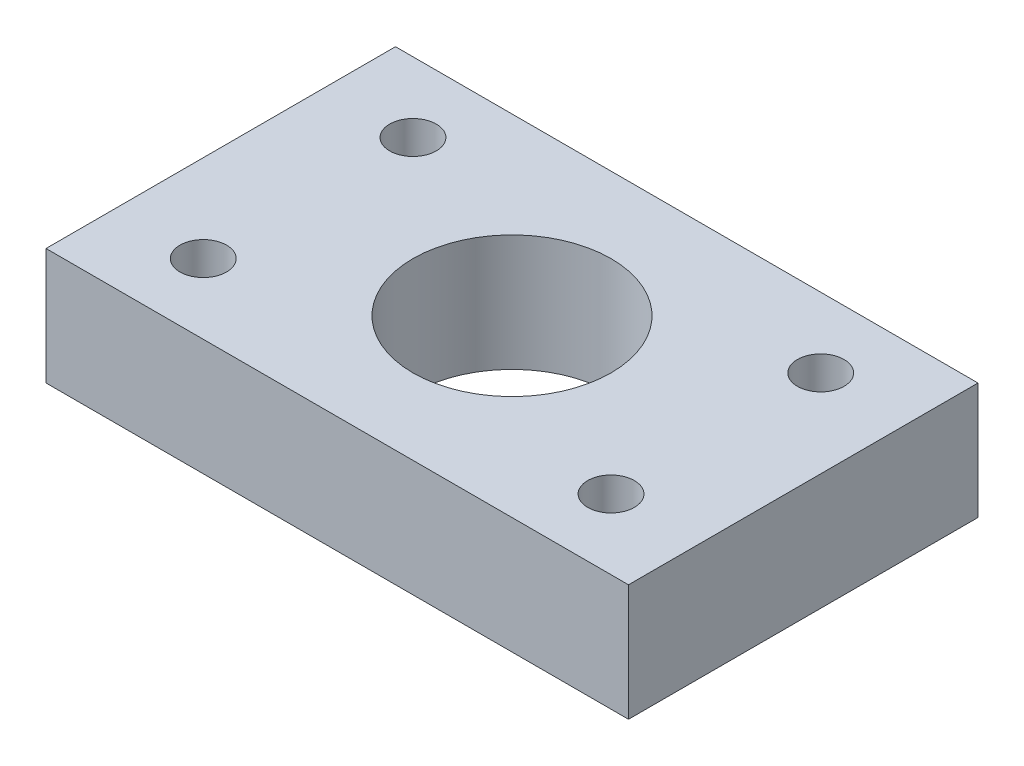
ISO-10303-21;
HEADER;
FILE_DESCRIPTION(('STEP AP214'),'2;1');
FILE_NAME('part.step','',(''),(''),'','','');
FILE_SCHEMA(('AUTOMOTIVE_DESIGN { 1 0 10303 214 1 1 1 1 }'));
ENDSEC;
DATA;
#1=APPLICATION_CONTEXT('core data for automotive mechanical design processes');
#2=APPLICATION_PROTOCOL_DEFINITION('international standard','automotive_design',2000,#1);
#3=PRODUCT_CONTEXT('',#1,'mechanical');
#4=PRODUCT('Part','Part','',(#3));
#5=PRODUCT_RELATED_PRODUCT_CATEGORY('part','',(#4));
#6=PRODUCT_DEFINITION_FORMATION('','',#4);
#7=PRODUCT_DEFINITION_CONTEXT('part definition',#1,'design');
#8=PRODUCT_DEFINITION('design','',#6,#7);
#9=PRODUCT_DEFINITION_SHAPE('','',#8);
#10=(LENGTH_UNIT() NAMED_UNIT(*) SI_UNIT(.MILLI.,.METRE.));
#11=(NAMED_UNIT(*) PLANE_ANGLE_UNIT() SI_UNIT($,.RADIAN.));
#12=(NAMED_UNIT(*) SI_UNIT($,.STERADIAN.) SOLID_ANGLE_UNIT());
#13=UNCERTAINTY_MEASURE_WITH_UNIT(LENGTH_MEASURE(1.E-05),#10,'distance_accuracy_value','');
#14=(GEOMETRIC_REPRESENTATION_CONTEXT(3) GLOBAL_UNCERTAINTY_ASSIGNED_CONTEXT((#13)) GLOBAL_UNIT_ASSIGNED_CONTEXT((#10,
#11,#12)) REPRESENTATION_CONTEXT('',''));
#15=CARTESIAN_POINT('',(0.,0.,0.));
#16=DIRECTION('',(0.,0.,1.));
#17=DIRECTION('',(1.,0.,0.));
#18=AXIS2_PLACEMENT_3D('',#15,#16,#17);
#19=CARTESIAN_POINT('',(0.,10.,0.));
#20=DIRECTION('',(0.,1.,0.));
#21=DIRECTION('',(0.,0.,1.));
#22=AXIS2_PLACEMENT_3D('',#19,#20,#21);
#23=PLANE('',#22);
#24=CARTESIAN_POINT('',(17.5,10.,9.00000000000001));
#25=DIRECTION('',(0.,1.,0.));
#26=DIRECTION('',(0.,0.,1.));
#27=AXIS2_PLACEMENT_3D('',#24,#25,#26);
#28=CIRCLE('',#27,2.);
#29=CARTESIAN_POINT('',(17.5,10.,11.));
#30=VERTEX_POINT('',#29);
#31=EDGE_CURVE('E128',#30,#30,#28,.T.);
#32=ORIENTED_EDGE('',*,*,#31,.F.);
#33=EDGE_LOOP('',(#32));
#34=FACE_BOUND('',#33,.T.);
#35=CARTESIAN_POINT('',(-17.5,10.,-9.));
#36=DIRECTION('',(0.,1.,0.));
#37=DIRECTION('',(0.,0.,1.));
#38=AXIS2_PLACEMENT_3D('',#35,#36,#37);
#39=CIRCLE('',#38,2.);
#40=CARTESIAN_POINT('',(-17.5,10.,-7.));
#41=VERTEX_POINT('',#40);
#42=EDGE_CURVE('E116',#41,#41,#39,.T.);
#43=ORIENTED_EDGE('',*,*,#42,.F.);
#44=EDGE_LOOP('',(#43));
#45=FACE_BOUND('',#44,.T.);
#46=DIRECTION('',(0.,0.,1.));
#47=VECTOR('',#46,1.);
#48=CARTESIAN_POINT('',(-25.,10.,15.));
#49=LINE('',#48,#47);
#50=CARTESIAN_POINT('',(-25.,10.,-15.));
#51=VERTEX_POINT('',#50);
#52=CARTESIAN_POINT('',(-25.,10.,15.));
#53=VERTEX_POINT('',#52);
#54=EDGE_CURVE('E86',#51,#53,#49,.T.);
#55=ORIENTED_EDGE('',*,*,#54,.T.);
#56=DIRECTION('',(1.,0.,0.));
#57=VECTOR('',#56,1.);
#58=CARTESIAN_POINT('',(25.,10.,15.));
#59=LINE('',#58,#57);
#60=CARTESIAN_POINT('',(25.,10.,15.));
#61=VERTEX_POINT('',#60);
#62=EDGE_CURVE('E81',#53,#61,#59,.T.);
#63=ORIENTED_EDGE('',*,*,#62,.T.);
#64=DIRECTION('',(0.,0.,-1.));
#65=VECTOR('',#64,1.);
#66=CARTESIAN_POINT('',(25.,10.,15.));
#67=LINE('',#66,#65);
#68=CARTESIAN_POINT('',(25.,10.,-15.));
#69=VERTEX_POINT('',#68);
#70=EDGE_CURVE('E84',#61,#69,#67,.T.);
#71=ORIENTED_EDGE('',*,*,#70,.T.);
#72=DIRECTION('',(-1.,0.,0.));
#73=VECTOR('',#72,1.);
#74=CARTESIAN_POINT('',(25.,10.,-15.));
#75=LINE('',#74,#73);
#76=EDGE_CURVE('E51',#69,#51,#75,.T.);
#77=ORIENTED_EDGE('',*,*,#76,.T.);
#78=EDGE_LOOP('',(#55,#63,#71,#77));
#79=FACE_BOUND('',#78,.T.);
#80=CARTESIAN_POINT('',(0.,10.,0.));
#81=DIRECTION('',(0.,1.,0.));
#82=DIRECTION('',(0.,0.,1.));
#83=AXIS2_PLACEMENT_3D('',#80,#81,#82);
#84=CIRCLE('',#83,8.5);
#85=CARTESIAN_POINT('',(0.,10.,8.5));
#86=VERTEX_POINT('',#85);
#87=EDGE_CURVE('E101',#86,#86,#84,.T.);
#88=ORIENTED_EDGE('',*,*,#87,.F.);
#89=EDGE_LOOP('',(#88));
#90=FACE_BOUND('',#89,.T.);
#91=CARTESIAN_POINT('',(17.5,10.,-9.00000000000001));
#92=DIRECTION('',(0.,1.,0.));
#93=DIRECTION('',(0.,0.,-1.));
#94=AXIS2_PLACEMENT_3D('',#91,#92,#93);
#95=CIRCLE('',#94,2.);
#96=CARTESIAN_POINT('',(17.5,10.,-11.));
#97=VERTEX_POINT('',#96);
#98=EDGE_CURVE('E122',#97,#97,#95,.T.);
#99=ORIENTED_EDGE('',*,*,#98,.F.);
#100=EDGE_LOOP('',(#99));
#101=FACE_BOUND('',#100,.T.);
#102=CARTESIAN_POINT('',(-17.5,10.,9.));
#103=DIRECTION('',(0.,1.,0.));
#104=DIRECTION('',(0.,0.,-1.));
#105=AXIS2_PLACEMENT_3D('',#102,#103,#104);
#106=CIRCLE('',#105,2.);
#107=CARTESIAN_POINT('',(-17.5,10.,7.));
#108=VERTEX_POINT('',#107);
#109=EDGE_CURVE('E134',#108,#108,#106,.T.);
#110=ORIENTED_EDGE('',*,*,#109,.F.);
#111=EDGE_LOOP('',(#110));
#112=FACE_BOUND('',#111,.T.);
#113=ADVANCED_FACE('F34',(#34,#45,#79,#90,#101,#112),#23,.T.);
#114=CARTESIAN_POINT('',(0.,0.,0.));
#115=DIRECTION('',(0.,1.,0.));
#116=DIRECTION('',(0.,0.,1.));
#117=AXIS2_PLACEMENT_3D('',#114,#115,#116);
#118=PLANE('',#117);
#119=DIRECTION('',(0.,0.,1.));
#120=VECTOR('',#119,1.);
#121=CARTESIAN_POINT('',(-25.,0.,15.));
#122=LINE('',#121,#120);
#123=CARTESIAN_POINT('',(-25.,0.,-15.));
#124=VERTEX_POINT('',#123);
#125=CARTESIAN_POINT('',(-25.,0.,15.));
#126=VERTEX_POINT('',#125);
#127=EDGE_CURVE('E98',#124,#126,#122,.T.);
#128=ORIENTED_EDGE('',*,*,#127,.F.);
#129=DIRECTION('',(-1.,0.,0.));
#130=VECTOR('',#129,1.);
#131=CARTESIAN_POINT('',(25.,0.,-15.));
#132=LINE('',#131,#130);
#133=CARTESIAN_POINT('',(25.,0.,-15.));
#134=VERTEX_POINT('',#133);
#135=EDGE_CURVE('E74',#134,#124,#132,.T.);
#136=ORIENTED_EDGE('',*,*,#135,.F.);
#137=DIRECTION('',(0.,0.,-1.));
#138=VECTOR('',#137,1.);
#139=CARTESIAN_POINT('',(25.,0.,15.));
#140=LINE('',#139,#138);
#141=CARTESIAN_POINT('',(25.,0.,15.));
#142=VERTEX_POINT('',#141);
#143=EDGE_CURVE('E68',#142,#134,#140,.T.);
#144=ORIENTED_EDGE('',*,*,#143,.F.);
#145=DIRECTION('',(1.,0.,0.));
#146=VECTOR('',#145,1.);
#147=CARTESIAN_POINT('',(25.,0.,15.));
#148=LINE('',#147,#146);
#149=EDGE_CURVE('E90',#126,#142,#148,.T.);
#150=ORIENTED_EDGE('',*,*,#149,.F.);
#151=EDGE_LOOP('',(#128,#136,#144,#150));
#152=FACE_BOUND('',#151,.T.);
#153=CARTESIAN_POINT('',(0.,0.,0.));
#154=DIRECTION('',(0.,1.,0.));
#155=DIRECTION('',(0.,0.,1.));
#156=AXIS2_PLACEMENT_3D('',#153,#154,#155);
#157=CIRCLE('',#156,8.5);
#158=CARTESIAN_POINT('',(0.,0.,8.5));
#159=VERTEX_POINT('',#158);
#160=EDGE_CURVE('E113',#159,#159,#157,.T.);
#161=ORIENTED_EDGE('',*,*,#160,.T.);
#162=EDGE_LOOP('',(#161));
#163=FACE_BOUND('',#162,.T.);
#164=CARTESIAN_POINT('',(-17.5,0.,-9.));
#165=DIRECTION('',(0.,1.,0.));
#166=DIRECTION('',(0.,0.,1.));
#167=AXIS2_PLACEMENT_3D('',#164,#165,#166);
#168=CIRCLE('',#167,2.);
#169=CARTESIAN_POINT('',(-17.5,0.,-7.));
#170=VERTEX_POINT('',#169);
#171=EDGE_CURVE('E119',#170,#170,#168,.T.);
#172=ORIENTED_EDGE('',*,*,#171,.T.);
#173=EDGE_LOOP('',(#172));
#174=FACE_BOUND('',#173,.T.);
#175=CARTESIAN_POINT('',(17.5,0.,-9.00000000000001));
#176=DIRECTION('',(0.,1.,0.));
#177=DIRECTION('',(0.,0.,-1.));
#178=AXIS2_PLACEMENT_3D('',#175,#176,#177);
#179=CIRCLE('',#178,2.);
#180=CARTESIAN_POINT('',(17.5,0.,-11.));
#181=VERTEX_POINT('',#180);
#182=EDGE_CURVE('E125',#181,#181,#179,.T.);
#183=ORIENTED_EDGE('',*,*,#182,.T.);
#184=EDGE_LOOP('',(#183));
#185=FACE_BOUND('',#184,.T.);
#186=CARTESIAN_POINT('',(17.5,0.,9.00000000000001));
#187=DIRECTION('',(0.,1.,0.));
#188=DIRECTION('',(0.,0.,1.));
#189=AXIS2_PLACEMENT_3D('',#186,#187,#188);
#190=CIRCLE('',#189,2.);
#191=CARTESIAN_POINT('',(17.5,0.,11.));
#192=VERTEX_POINT('',#191);
#193=EDGE_CURVE('E131',#192,#192,#190,.T.);
#194=ORIENTED_EDGE('',*,*,#193,.T.);
#195=EDGE_LOOP('',(#194));
#196=FACE_BOUND('',#195,.T.);
#197=CARTESIAN_POINT('',(-17.5,0.,9.));
#198=DIRECTION('',(0.,1.,0.));
#199=DIRECTION('',(0.,0.,-1.));
#200=AXIS2_PLACEMENT_3D('',#197,#198,#199);
#201=CIRCLE('',#200,2.);
#202=CARTESIAN_POINT('',(-17.5,0.,7.));
#203=VERTEX_POINT('',#202);
#204=EDGE_CURVE('E137',#203,#203,#201,.T.);
#205=ORIENTED_EDGE('',*,*,#204,.T.);
#206=EDGE_LOOP('',(#205));
#207=FACE_BOUND('',#206,.T.);
#208=ADVANCED_FACE('F109',(#152,#163,#174,#185,#196,#207),#118,.F.);
#209=CARTESIAN_POINT('',(-25.,10.,15.));
#210=DIRECTION('',(1.,0.,0.));
#211=DIRECTION('',(0.,0.,-1.));
#212=AXIS2_PLACEMENT_3D('',#209,#210,#211);
#213=PLANE('',#212);
#214=ORIENTED_EDGE('',*,*,#127,.T.);
#215=DIRECTION('',(0.,-1.,0.));
#216=VECTOR('',#215,1.);
#217=CARTESIAN_POINT('',(-25.,10.,15.));
#218=LINE('',#217,#216);
#219=EDGE_CURVE('E11',#53,#126,#218,.T.);
#220=ORIENTED_EDGE('',*,*,#219,.F.);
#221=ORIENTED_EDGE('',*,*,#54,.F.);
#222=DIRECTION('',(0.,-1.,0.));
#223=VECTOR('',#222,1.);
#224=CARTESIAN_POINT('',(-25.,10.,-15.));
#225=LINE('',#224,#223);
#226=EDGE_CURVE('E94',#51,#124,#225,.T.);
#227=ORIENTED_EDGE('',*,*,#226,.T.);
#228=EDGE_LOOP('',(#214,#220,#221,#227));
#229=FACE_BOUND('',#228,.T.);
#230=ADVANCED_FACE('F36',(#229),#213,.F.);
#231=CARTESIAN_POINT('',(25.,10.,15.));
#232=DIRECTION('',(0.,0.,-1.));
#233=DIRECTION('',(-1.,0.,0.));
#234=AXIS2_PLACEMENT_3D('',#231,#232,#233);
#235=PLANE('',#234);
#236=ORIENTED_EDGE('',*,*,#149,.T.);
#237=DIRECTION('',(0.,-1.,0.));
#238=VECTOR('',#237,1.);
#239=CARTESIAN_POINT('',(25.,10.,15.));
#240=LINE('',#239,#238);
#241=EDGE_CURVE('E43',#61,#142,#240,.T.);
#242=ORIENTED_EDGE('',*,*,#241,.F.);
#243=ORIENTED_EDGE('',*,*,#62,.F.);
#244=ORIENTED_EDGE('',*,*,#219,.T.);
#245=EDGE_LOOP('',(#236,#242,#243,#244));
#246=FACE_BOUND('',#245,.T.);
#247=ADVANCED_FACE('F89',(#246),#235,.F.);
#248=CARTESIAN_POINT('',(25.,10.,15.));
#249=DIRECTION('',(-1.,0.,0.));
#250=DIRECTION('',(0.,0.,1.));
#251=AXIS2_PLACEMENT_3D('',#248,#249,#250);
#252=PLANE('',#251);
#253=ORIENTED_EDGE('',*,*,#143,.T.);
#254=DIRECTION('',(0.,-1.,0.));
#255=VECTOR('',#254,1.);
#256=CARTESIAN_POINT('',(25.,10.,-15.));
#257=LINE('',#256,#255);
#258=EDGE_CURVE('E91',#69,#134,#257,.T.);
#259=ORIENTED_EDGE('',*,*,#258,.F.);
#260=ORIENTED_EDGE('',*,*,#70,.F.);
#261=ORIENTED_EDGE('',*,*,#241,.T.);
#262=EDGE_LOOP('',(#253,#259,#260,#261));
#263=FACE_BOUND('',#262,.T.);
#264=ADVANCED_FACE('F92',(#263),#252,.F.);
#265=CARTESIAN_POINT('',(25.,10.,-15.));
#266=DIRECTION('',(0.,0.,1.));
#267=DIRECTION('',(1.,0.,0.));
#268=AXIS2_PLACEMENT_3D('',#265,#266,#267);
#269=PLANE('',#268);
#270=ORIENTED_EDGE('',*,*,#135,.T.);
#271=ORIENTED_EDGE('',*,*,#226,.F.);
#272=ORIENTED_EDGE('',*,*,#76,.F.);
#273=ORIENTED_EDGE('',*,*,#258,.T.);
#274=EDGE_LOOP('',(#270,#271,#272,#273));
#275=FACE_BOUND('',#274,.T.);
#276=ADVANCED_FACE('F106',(#275),#269,.F.);
#277=CARTESIAN_POINT('',(0.,10.,0.));
#278=DIRECTION('',(0.,-1.,0.));
#279=DIRECTION('',(0.,0.,-1.));
#280=AXIS2_PLACEMENT_3D('',#277,#278,#279);
#281=CYLINDRICAL_SURFACE('',#280,8.5);
#282=ORIENTED_EDGE('',*,*,#87,.T.);
#283=EDGE_LOOP('',(#282));
#284=FACE_BOUND('',#283,.T.);
#285=ORIENTED_EDGE('',*,*,#160,.F.);
#286=EDGE_LOOP('',(#285));
#287=FACE_BOUND('',#286,.T.);
#288=ADVANCED_FACE('F156',(#284,#287),#281,.F.);
#289=CARTESIAN_POINT('',(-17.5,10.,-9.));
#290=DIRECTION('',(0.,-1.,0.));
#291=DIRECTION('',(0.,0.,-1.));
#292=AXIS2_PLACEMENT_3D('',#289,#290,#291);
#293=CYLINDRICAL_SURFACE('',#292,2.);
#294=ORIENTED_EDGE('',*,*,#42,.T.);
#295=EDGE_LOOP('',(#294));
#296=FACE_BOUND('',#295,.T.);
#297=ORIENTED_EDGE('',*,*,#171,.F.);
#298=EDGE_LOOP('',(#297));
#299=FACE_BOUND('',#298,.T.);
#300=ADVANCED_FACE('F202',(#296,#299),#293,.F.);
#301=CARTESIAN_POINT('',(17.5,10.,-9.00000000000001));
#302=DIRECTION('',(0.,-1.,0.));
#303=DIRECTION('',(0.,0.,-1.));
#304=AXIS2_PLACEMENT_3D('',#301,#302,#303);
#305=CYLINDRICAL_SURFACE('',#304,2.);
#306=ORIENTED_EDGE('',*,*,#98,.T.);
#307=EDGE_LOOP('',(#306));
#308=FACE_BOUND('',#307,.T.);
#309=ORIENTED_EDGE('',*,*,#182,.F.);
#310=EDGE_LOOP('',(#309));
#311=FACE_BOUND('',#310,.T.);
#312=ADVANCED_FACE('F210',(#308,#311),#305,.F.);
#313=CARTESIAN_POINT('',(17.5,10.,9.00000000000001));
#314=DIRECTION('',(0.,-1.,0.));
#315=DIRECTION('',(0.,0.,-1.));
#316=AXIS2_PLACEMENT_3D('',#313,#314,#315);
#317=CYLINDRICAL_SURFACE('',#316,2.);
#318=ORIENTED_EDGE('',*,*,#31,.T.);
#319=EDGE_LOOP('',(#318));
#320=FACE_BOUND('',#319,.T.);
#321=ORIENTED_EDGE('',*,*,#193,.F.);
#322=EDGE_LOOP('',(#321));
#323=FACE_BOUND('',#322,.T.);
#324=ADVANCED_FACE('F218',(#320,#323),#317,.F.);
#325=CARTESIAN_POINT('',(-17.5,10.,9.));
#326=DIRECTION('',(0.,-1.,0.));
#327=DIRECTION('',(0.,0.,-1.));
#328=AXIS2_PLACEMENT_3D('',#325,#326,#327);
#329=CYLINDRICAL_SURFACE('',#328,2.);
#330=ORIENTED_EDGE('',*,*,#109,.T.);
#331=EDGE_LOOP('',(#330));
#332=FACE_BOUND('',#331,.T.);
#333=ORIENTED_EDGE('',*,*,#204,.F.);
#334=EDGE_LOOP('',(#333));
#335=FACE_BOUND('',#334,.T.);
#336=ADVANCED_FACE('F143',(#332,#335),#329,.F.);
#337=CLOSED_SHELL('',(#113,#208,#230,#247,#264,#276,#288,#300,#312,#324,#336));
#338=MANIFOLD_SOLID_BREP('B2',#337);
#339=ADVANCED_BREP_SHAPE_REPRESENTATION('',(#18,#338),#14);
#340=SHAPE_DEFINITION_REPRESENTATION(#9,#339);
ENDSEC;
END-ISO-10303-21;
